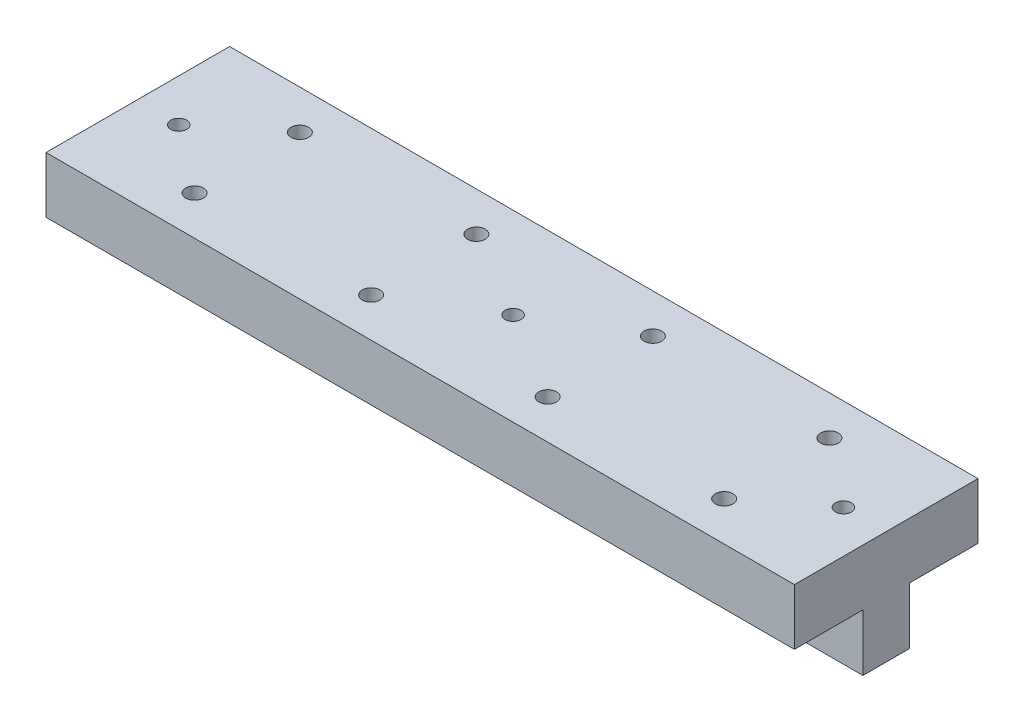
ISO-10303-21;
HEADER;
FILE_DESCRIPTION(('STEP AP214'),'2;1');
FILE_NAME('part.step','',(''),(''),'','','');
FILE_SCHEMA(('AUTOMOTIVE_DESIGN { 1 0 10303 214 1 1 1 1 }'));
ENDSEC;
DATA;
#1=APPLICATION_CONTEXT('core data for automotive mechanical design processes');
#2=APPLICATION_PROTOCOL_DEFINITION('international standard','automotive_design',2000,#1);
#3=PRODUCT_CONTEXT('',#1,'mechanical');
#4=PRODUCT('Part','Part','',(#3));
#5=PRODUCT_RELATED_PRODUCT_CATEGORY('part','',(#4));
#6=PRODUCT_DEFINITION_FORMATION('','',#4);
#7=PRODUCT_DEFINITION_CONTEXT('part definition',#1,'design');
#8=PRODUCT_DEFINITION('design','',#6,#7);
#9=PRODUCT_DEFINITION_SHAPE('','',#8);
#10=(LENGTH_UNIT() NAMED_UNIT(*) SI_UNIT(.MILLI.,.METRE.));
#11=(NAMED_UNIT(*) PLANE_ANGLE_UNIT() SI_UNIT($,.RADIAN.));
#12=(NAMED_UNIT(*) SI_UNIT($,.STERADIAN.) SOLID_ANGLE_UNIT());
#13=UNCERTAINTY_MEASURE_WITH_UNIT(LENGTH_MEASURE(1.E-05),#10,'distance_accuracy_value','');
#14=(GEOMETRIC_REPRESENTATION_CONTEXT(3) GLOBAL_UNCERTAINTY_ASSIGNED_CONTEXT((#13)) GLOBAL_UNIT_ASSIGNED_CONTEXT((#10,
#11,#12)) REPRESENTATION_CONTEXT('',''));
#15=CARTESIAN_POINT('',(0.,0.,0.));
#16=DIRECTION('',(0.,0.,1.));
#17=DIRECTION('',(1.,0.,0.));
#18=AXIS2_PLACEMENT_3D('',#15,#16,#17);
#19=CARTESIAN_POINT('',(-89.8910476017454,-16.65,-13.));
#20=DIRECTION('',(0.,1.,0.));
#21=DIRECTION('',(0.,0.,1.));
#22=AXIS2_PLACEMENT_3D('',#19,#20,#21);
#23=PLANE('',#22);
#24=DIRECTION('',(-1.,0.,0.));
#25=VECTOR('',#24,1.);
#26=CARTESIAN_POINT('',(-89.8910476017454,-16.65,0.));
#27=LINE('',#26,#25);
#28=CARTESIAN_POINT('',(16.1089523982546,-16.65,0.));
#29=VERTEX_POINT('',#28);
#30=CARTESIAN_POINT('',(-89.8910476017454,-16.65,0.));
#31=VERTEX_POINT('',#30);
#32=EDGE_CURVE('E170',#29,#31,#27,.T.);
#33=ORIENTED_EDGE('',*,*,#32,.F.);
#34=DIRECTION('',(0.,0.,1.));
#35=VECTOR('',#34,1.);
#36=CARTESIAN_POINT('',(16.1089523982546,-16.65,-13.));
#37=LINE('',#36,#35);
#38=CARTESIAN_POINT('',(16.1089523982546,-16.65,-26.));
#39=VERTEX_POINT('',#38);
#40=EDGE_CURVE('E177',#39,#29,#37,.T.);
#41=ORIENTED_EDGE('',*,*,#40,.F.);
#42=DIRECTION('',(-1.,0.,0.));
#43=VECTOR('',#42,1.);
#44=CARTESIAN_POINT('',(-89.8910476017454,-16.65,-26.));
#45=LINE('',#44,#43);
#46=CARTESIAN_POINT('',(-89.8910476017454,-16.65,-26.));
#47=VERTEX_POINT('',#46);
#48=EDGE_CURVE('E121',#39,#47,#45,.T.);
#49=ORIENTED_EDGE('',*,*,#48,.T.);
#50=DIRECTION('',(0.,0.,1.));
#51=VECTOR('',#50,1.);
#52=CARTESIAN_POINT('',(-89.8910476017454,-16.65,-13.));
#53=LINE('',#52,#51);
#54=EDGE_CURVE('E174',#47,#31,#53,.T.);
#55=ORIENTED_EDGE('',*,*,#54,.T.);
#56=EDGE_LOOP('',(#33,#41,#49,#55));
#57=FACE_BOUND('',#56,.T.);
#58=CARTESIAN_POINT('',(-24.3910476017454,-16.65,-5.55));
#59=DIRECTION('',(0.,1.,0.));
#60=DIRECTION('',(0.,0.,1.));
#61=AXIS2_PLACEMENT_3D('',#58,#59,#60);
#62=CIRCLE('',#61,1.25);
#63=CARTESIAN_POINT('',(-24.3910476017454,-16.65,-4.3));
#64=VERTEX_POINT('',#63);
#65=EDGE_CURVE('E148',#64,#64,#62,.T.);
#66=ORIENTED_EDGE('',*,*,#65,.F.);
#67=EDGE_LOOP('',(#66));
#68=FACE_BOUND('',#67,.T.);
#69=CARTESIAN_POINT('',(0.608952398254592,-16.65,-5.55));
#70=DIRECTION('',(0.,1.,0.));
#71=DIRECTION('',(0.,0.,1.));
#72=AXIS2_PLACEMENT_3D('',#69,#70,#71);
#73=CIRCLE('',#72,1.25);
#74=CARTESIAN_POINT('',(0.608952398254592,-16.65,-4.3));
#75=VERTEX_POINT('',#74);
#76=EDGE_CURVE('E142',#75,#75,#73,.T.);
#77=ORIENTED_EDGE('',*,*,#76,.F.);
#78=EDGE_LOOP('',(#77));
#79=FACE_BOUND('',#78,.T.);
#80=CARTESIAN_POINT('',(-49.3910476017454,-16.65,-5.55));
#81=DIRECTION('',(0.,1.,0.));
#82=DIRECTION('',(0.,0.,1.));
#83=AXIS2_PLACEMENT_3D('',#80,#81,#82);
#84=CIRCLE('',#83,1.24999999999999);
#85=CARTESIAN_POINT('',(-49.3910476017454,-16.65,-4.30000000000001));
#86=VERTEX_POINT('',#85);
#87=EDGE_CURVE('E136',#86,#86,#84,.T.);
#88=ORIENTED_EDGE('',*,*,#87,.F.);
#89=EDGE_LOOP('',(#88));
#90=FACE_BOUND('',#89,.T.);
#91=CARTESIAN_POINT('',(-74.3910476017454,-16.65,-5.55));
#92=DIRECTION('',(0.,1.,0.));
#93=DIRECTION('',(0.,0.,1.));
#94=AXIS2_PLACEMENT_3D('',#91,#92,#93);
#95=CIRCLE('',#94,1.25);
#96=CARTESIAN_POINT('',(-74.3910476017454,-16.65,-4.3));
#97=VERTEX_POINT('',#96);
#98=EDGE_CURVE('E130',#97,#97,#95,.T.);
#99=ORIENTED_EDGE('',*,*,#98,.F.);
#100=EDGE_LOOP('',(#99));
#101=FACE_BOUND('',#100,.T.);
#102=CARTESIAN_POINT('',(-24.3910476017454,-16.65,-20.45));
#103=DIRECTION('',(0.,1.,0.));
#104=DIRECTION('',(0.,0.,1.));
#105=AXIS2_PLACEMENT_3D('',#102,#103,#104);
#106=CIRCLE('',#105,1.25);
#107=CARTESIAN_POINT('',(-24.3910476017454,-16.65,-19.2));
#108=VERTEX_POINT('',#107);
#109=EDGE_CURVE('E207',#108,#108,#106,.T.);
#110=ORIENTED_EDGE('',*,*,#109,.F.);
#111=EDGE_LOOP('',(#110));
#112=FACE_BOUND('',#111,.T.);
#113=CARTESIAN_POINT('',(0.608952398254592,-16.65,-20.45));
#114=DIRECTION('',(0.,1.,0.));
#115=DIRECTION('',(0.,0.,1.));
#116=AXIS2_PLACEMENT_3D('',#113,#114,#115);
#117=CIRCLE('',#116,1.25);
#118=CARTESIAN_POINT('',(0.608952398254592,-16.65,-19.2));
#119=VERTEX_POINT('',#118);
#120=EDGE_CURVE('E189',#119,#119,#117,.T.);
#121=ORIENTED_EDGE('',*,*,#120,.F.);
#122=EDGE_LOOP('',(#121));
#123=FACE_BOUND('',#122,.T.);
#124=CARTESIAN_POINT('',(-49.3910476017454,-16.65,-20.45));
#125=DIRECTION('',(0.,1.,0.));
#126=DIRECTION('',(0.,0.,1.));
#127=AXIS2_PLACEMENT_3D('',#124,#125,#126);
#128=CIRCLE('',#127,1.24999999999999);
#129=CARTESIAN_POINT('',(-49.3910476017454,-16.65,-19.2));
#130=VERTEX_POINT('',#129);
#131=EDGE_CURVE('E190',#130,#130,#128,.T.);
#132=ORIENTED_EDGE('',*,*,#131,.F.);
#133=EDGE_LOOP('',(#132));
#134=FACE_BOUND('',#133,.T.);
#135=CARTESIAN_POINT('',(-74.3910476017454,-16.65,-20.45));
#136=DIRECTION('',(0.,1.,0.));
#137=DIRECTION('',(0.,0.,1.));
#138=AXIS2_PLACEMENT_3D('',#135,#136,#137);
#139=CIRCLE('',#138,1.25);
#140=CARTESIAN_POINT('',(-74.3910476017454,-16.65,-19.2));
#141=VERTEX_POINT('',#140);
#142=EDGE_CURVE('E201',#141,#141,#139,.T.);
#143=ORIENTED_EDGE('',*,*,#142,.F.);
#144=EDGE_LOOP('',(#143));
#145=FACE_BOUND('',#144,.T.);
#146=CARTESIAN_POINT('',(-36.8910476017454,-16.65,-13.1568071765675));
#147=DIRECTION('',(0.,-1.,0.));
#148=DIRECTION('',(0.,0.,-1.));
#149=AXIS2_PLACEMENT_3D('',#146,#147,#148);
#150=CIRCLE('',#149,1.13029999999999);
#151=CARTESIAN_POINT('',(-36.8910476017454,-16.65,-14.2871071765675));
#152=VERTEX_POINT('',#151);
#153=EDGE_CURVE('E480',#152,#152,#150,.T.);
#154=ORIENTED_EDGE('',*,*,#153,.T.);
#155=EDGE_LOOP('',(#154));
#156=FACE_BOUND('',#155,.T.);
#157=CARTESIAN_POINT('',(10.1089523982546,-16.65,-12.9381847081124));
#158=DIRECTION('',(0.,-1.,0.));
#159=DIRECTION('',(0.,0.,-1.));
#160=AXIS2_PLACEMENT_3D('',#157,#158,#159);
#161=CIRCLE('',#160,1.1303);
#162=CARTESIAN_POINT('',(10.1089523982546,-16.65,-14.0684847081123));
#163=VERTEX_POINT('',#162);
#164=EDGE_CURVE('E484',#163,#163,#161,.T.);
#165=ORIENTED_EDGE('',*,*,#164,.T.);
#166=EDGE_LOOP('',(#165));
#167=FACE_BOUND('',#166,.T.);
#168=CARTESIAN_POINT('',(-83.8910476017454,-16.65,-12.8014145682755));
#169=DIRECTION('',(0.,-1.,0.));
#170=DIRECTION('',(0.,0.,-1.));
#171=AXIS2_PLACEMENT_3D('',#168,#169,#170);
#172=CIRCLE('',#171,1.1303);
#173=CARTESIAN_POINT('',(-83.8910476017454,-16.65,-13.9317145682755));
#174=VERTEX_POINT('',#173);
#175=EDGE_CURVE('E487',#174,#174,#172,.T.);
#176=ORIENTED_EDGE('',*,*,#175,.T.);
#177=EDGE_LOOP('',(#176));
#178=FACE_BOUND('',#177,.T.);
#179=ADVANCED_FACE('F35',(#57,#68,#79,#90,#101,#112,#123,#134,#145,#156,#167,#178),#23,.T.);
#180=CARTESIAN_POINT('',(-89.8910476017454,-32.65,-13.));
#181=DIRECTION('',(0.,-1.,0.));
#182=DIRECTION('',(0.,0.,-1.));
#183=AXIS2_PLACEMENT_3D('',#180,#181,#182);
#184=PLANE('',#183);
#185=CARTESIAN_POINT('',(-83.8910476017454,-32.65,-12.8014145682755));
#186=DIRECTION('',(0.,-1.,0.));
#187=DIRECTION('',(0.,0.,-1.));
#188=AXIS2_PLACEMENT_3D('',#185,#186,#187);
#189=CIRCLE('',#188,1.1303);
#190=CARTESIAN_POINT('',(-83.8910476017454,-32.65,-13.9317145682755));
#191=VERTEX_POINT('',#190);
#192=EDGE_CURVE('E489',#191,#191,#189,.T.);
#193=ORIENTED_EDGE('',*,*,#192,.F.);
#194=EDGE_LOOP('',(#193));
#195=FACE_BOUND('',#194,.T.);
#196=CARTESIAN_POINT('',(10.1089523982546,-32.65,-12.9381847081124));
#197=DIRECTION('',(0.,-1.,0.));
#198=DIRECTION('',(0.,0.,-1.));
#199=AXIS2_PLACEMENT_3D('',#196,#197,#198);
#200=CIRCLE('',#199,1.1303);
#201=CARTESIAN_POINT('',(10.1089523982546,-32.65,-14.0684847081124));
#202=VERTEX_POINT('',#201);
#203=EDGE_CURVE('E488',#202,#202,#200,.T.);
#204=ORIENTED_EDGE('',*,*,#203,.F.);
#205=EDGE_LOOP('',(#204));
#206=FACE_BOUND('',#205,.T.);
#207=CARTESIAN_POINT('',(-36.8910476017454,-32.65,-13.1568071765675));
#208=DIRECTION('',(0.,-1.,0.));
#209=DIRECTION('',(0.,0.,-1.));
#210=AXIS2_PLACEMENT_3D('',#207,#208,#209);
#211=CIRCLE('',#210,1.1303);
#212=CARTESIAN_POINT('',(-36.8910476017454,-32.65,-14.2871071765675));
#213=VERTEX_POINT('',#212);
#214=EDGE_CURVE('E497',#213,#213,#211,.T.);
#215=ORIENTED_EDGE('',*,*,#214,.F.);
#216=EDGE_LOOP('',(#215));
#217=FACE_BOUND('',#216,.T.);
#218=DIRECTION('',(0.,0.,1.));
#219=VECTOR('',#218,1.);
#220=CARTESIAN_POINT('',(-89.8910476017454,-32.65,-13.));
#221=LINE('',#220,#219);
#222=CARTESIAN_POINT('',(-89.8910476017454,-32.65,-16.3));
#223=VERTEX_POINT('',#222);
#224=CARTESIAN_POINT('',(-89.8910476017454,-32.65,-9.7));
#225=VERTEX_POINT('',#224);
#226=EDGE_CURVE('E173',#223,#225,#221,.T.);
#227=ORIENTED_EDGE('',*,*,#226,.F.);
#228=DIRECTION('',(1.,0.,0.));
#229=VECTOR('',#228,1.);
#230=CARTESIAN_POINT('',(-89.8910476017454,-32.65,-16.3));
#231=LINE('',#230,#229);
#232=CARTESIAN_POINT('',(16.1089523982546,-32.65,-16.3));
#233=VERTEX_POINT('',#232);
#234=EDGE_CURVE('E11',#223,#233,#231,.T.);
#235=ORIENTED_EDGE('',*,*,#234,.T.);
#236=DIRECTION('',(0.,0.,1.));
#237=VECTOR('',#236,1.);
#238=CARTESIAN_POINT('',(16.1089523982546,-32.65,-13.));
#239=LINE('',#238,#237);
#240=CARTESIAN_POINT('',(16.1089523982546,-32.65,-9.7));
#241=VERTEX_POINT('',#240);
#242=EDGE_CURVE('E180',#233,#241,#239,.T.);
#243=ORIENTED_EDGE('',*,*,#242,.T.);
#244=DIRECTION('',(-1.,0.,0.));
#245=VECTOR('',#244,1.);
#246=CARTESIAN_POINT('',(-89.8910476017454,-32.65,-9.7));
#247=LINE('',#246,#245);
#248=EDGE_CURVE('E184',#241,#225,#247,.T.);
#249=ORIENTED_EDGE('',*,*,#248,.T.);
#250=EDGE_LOOP('',(#227,#235,#243,#249));
#251=FACE_BOUND('',#250,.T.);
#252=ADVANCED_FACE('F217',(#195,#206,#217,#251),#184,.T.);
#253=CARTESIAN_POINT('',(-89.8910476017454,-16.65,-13.));
#254=DIRECTION('',(-1.,0.,0.));
#255=DIRECTION('',(0.,0.,1.));
#256=AXIS2_PLACEMENT_3D('',#253,#254,#255);
#257=PLANE('',#256);
#258=DIRECTION('',(0.,0.,1.));
#259=VECTOR('',#258,1.);
#260=CARTESIAN_POINT('',(-89.8910476017454,-24.6013169762694,-26.000012));
#261=LINE('',#260,#259);
#262=CARTESIAN_POINT('',(-89.8910476017454,-24.6013169762694,-26.));
#263=VERTEX_POINT('',#262);
#264=CARTESIAN_POINT('',(-89.8910476017454,-24.6013169762694,-16.3));
#265=VERTEX_POINT('',#264);
#266=EDGE_CURVE('E52',#263,#265,#261,.T.);
#267=ORIENTED_EDGE('',*,*,#266,.T.);
#268=DIRECTION('',(0.,-1.,0.));
#269=VECTOR('',#268,1.);
#270=CARTESIAN_POINT('',(-89.8910476017454,-24.6013169762694,-16.3));
#271=LINE('',#270,#269);
#272=EDGE_CURVE('E109',#265,#223,#271,.T.);
#273=ORIENTED_EDGE('',*,*,#272,.T.);
#274=ORIENTED_EDGE('',*,*,#226,.T.);
#275=DIRECTION('',(0.,-1.,0.));
#276=VECTOR('',#275,1.);
#277=CARTESIAN_POINT('',(-89.8910476017454,-24.6013169762694,-9.7));
#278=LINE('',#277,#276);
#279=CARTESIAN_POINT('',(-89.8910476017454,-24.6013169762694,-9.7));
#280=VERTEX_POINT('',#279);
#281=EDGE_CURVE('E154',#280,#225,#278,.T.);
#282=ORIENTED_EDGE('',*,*,#281,.F.);
#283=DIRECTION('',(0.,0.,-1.));
#284=VECTOR('',#283,1.);
#285=CARTESIAN_POINT('',(-89.8910476017454,-24.6013169762694,1.2E-05));
#286=LINE('',#285,#284);
#287=CARTESIAN_POINT('',(-89.8910476017454,-24.6013169762694,0.));
#288=VERTEX_POINT('',#287);
#289=EDGE_CURVE('E162',#288,#280,#286,.T.);
#290=ORIENTED_EDGE('',*,*,#289,.F.);
#291=DIRECTION('',(0.,-1.,0.));
#292=VECTOR('',#291,1.);
#293=CARTESIAN_POINT('',(-89.8910476017454,-16.65,0.));
#294=LINE('',#293,#292);
#295=EDGE_CURVE('E165',#31,#288,#294,.T.);
#296=ORIENTED_EDGE('',*,*,#295,.F.);
#297=ORIENTED_EDGE('',*,*,#54,.F.);
#298=DIRECTION('',(0.,-1.,0.));
#299=VECTOR('',#298,1.);
#300=CARTESIAN_POINT('',(-89.8910476017454,-16.65,-26.));
#301=LINE('',#300,#299);
#302=EDGE_CURVE('E119',#47,#263,#301,.T.);
#303=ORIENTED_EDGE('',*,*,#302,.T.);
#304=EDGE_LOOP('',(#267,#273,#274,#282,#290,#296,#297,#303));
#305=FACE_BOUND('',#304,.T.);
#306=ADVANCED_FACE('F37',(#305),#257,.T.);
#307=CARTESIAN_POINT('',(16.1089523982546,-16.65,-13.));
#308=DIRECTION('',(1.,0.,0.));
#309=DIRECTION('',(0.,0.,-1.));
#310=AXIS2_PLACEMENT_3D('',#307,#308,#309);
#311=PLANE('',#310);
#312=DIRECTION('',(0.,0.,1.));
#313=VECTOR('',#312,1.);
#314=CARTESIAN_POINT('',(16.1089523982546,-24.6013169762694,-26.000012));
#315=LINE('',#314,#313);
#316=CARTESIAN_POINT('',(16.1089523982546,-24.6013169762694,-26.));
#317=VERTEX_POINT('',#316);
#318=CARTESIAN_POINT('',(16.1089523982546,-24.6013169762694,-16.3));
#319=VERTEX_POINT('',#318);
#320=EDGE_CURVE('E105',#317,#319,#315,.T.);
#321=ORIENTED_EDGE('',*,*,#320,.F.);
#322=DIRECTION('',(0.,1.,0.));
#323=VECTOR('',#322,1.);
#324=CARTESIAN_POINT('',(16.1089523982546,-16.65,-26.));
#325=LINE('',#324,#323);
#326=EDGE_CURVE('E128',#317,#39,#325,.T.);
#327=ORIENTED_EDGE('',*,*,#326,.T.);
#328=ORIENTED_EDGE('',*,*,#40,.T.);
#329=DIRECTION('',(0.,1.,0.));
#330=VECTOR('',#329,1.);
#331=CARTESIAN_POINT('',(16.1089523982546,-16.65,0.));
#332=LINE('',#331,#330);
#333=CARTESIAN_POINT('',(16.1089523982546,-24.6013169762694,0.));
#334=VERTEX_POINT('',#333);
#335=EDGE_CURVE('E168',#334,#29,#332,.T.);
#336=ORIENTED_EDGE('',*,*,#335,.F.);
#337=DIRECTION('',(0.,0.,-1.));
#338=VECTOR('',#337,1.);
#339=CARTESIAN_POINT('',(16.1089523982546,-24.6013169762694,1.2E-05));
#340=LINE('',#339,#338);
#341=CARTESIAN_POINT('',(16.1089523982546,-24.6013169762694,-9.7));
#342=VERTEX_POINT('',#341);
#343=EDGE_CURVE('E60',#334,#342,#340,.T.);
#344=ORIENTED_EDGE('',*,*,#343,.T.);
#345=DIRECTION('',(0.,1.,0.));
#346=VECTOR('',#345,1.);
#347=CARTESIAN_POINT('',(16.1089523982546,-24.6013169762694,-9.7));
#348=LINE('',#347,#346);
#349=EDGE_CURVE('E157',#241,#342,#348,.T.);
#350=ORIENTED_EDGE('',*,*,#349,.F.);
#351=ORIENTED_EDGE('',*,*,#242,.F.);
#352=DIRECTION('',(0.,1.,0.));
#353=VECTOR('',#352,1.);
#354=CARTESIAN_POINT('',(16.1089523982546,-24.6013169762694,-16.3));
#355=LINE('',#354,#353);
#356=EDGE_CURVE('E108',#233,#319,#355,.T.);
#357=ORIENTED_EDGE('',*,*,#356,.T.);
#358=EDGE_LOOP('',(#321,#327,#328,#336,#344,#350,#351,#357));
#359=FACE_BOUND('',#358,.T.);
#360=ADVANCED_FACE('F213',(#359),#311,.T.);
#361=CARTESIAN_POINT('',(0.,0.,0.));
#362=DIRECTION('',(0.,0.,1.));
#363=DIRECTION('',(1.,0.,0.));
#364=AXIS2_PLACEMENT_3D('',#361,#362,#363);
#365=PLANE('',#364);
#366=ORIENTED_EDGE('',*,*,#295,.T.);
#367=DIRECTION('',(1.,0.,0.));
#368=VECTOR('',#367,1.);
#369=CARTESIAN_POINT('',(0.,-24.6013169762694,0.));
#370=LINE('',#369,#368);
#371=EDGE_CURVE('E176',#288,#334,#370,.T.);
#372=ORIENTED_EDGE('',*,*,#371,.T.);
#373=ORIENTED_EDGE('',*,*,#335,.T.);
#374=ORIENTED_EDGE('',*,*,#32,.T.);
#375=EDGE_LOOP('',(#366,#372,#373,#374));
#376=FACE_BOUND('',#375,.T.);
#377=ADVANCED_FACE('F228',(#376),#365,.T.);
#378=CARTESIAN_POINT('',(-89.8910476017454,-24.6013169762694,1.2E-05));
#379=DIRECTION('',(0.,-1.,0.));
#380=DIRECTION('',(0.,0.,-1.));
#381=AXIS2_PLACEMENT_3D('',#378,#379,#380);
#382=PLANE('',#381);
#383=CARTESIAN_POINT('',(-74.3910476017454,-24.6013169762694,-5.55));
#384=DIRECTION('',(0.,-1.,0.));
#385=DIRECTION('',(0.,0.,-1.));
#386=AXIS2_PLACEMENT_3D('',#383,#384,#385);
#387=CIRCLE('',#386,1.25);
#388=CARTESIAN_POINT('',(-74.3910476017454,-24.6013169762694,-6.8));
#389=VERTEX_POINT('',#388);
#390=EDGE_CURVE('E133',#389,#389,#387,.T.);
#391=ORIENTED_EDGE('',*,*,#390,.F.);
#392=EDGE_LOOP('',(#391));
#393=FACE_BOUND('',#392,.T.);
#394=CARTESIAN_POINT('',(-49.3910476017454,-24.6013169762694,-5.55));
#395=DIRECTION('',(0.,-1.,0.));
#396=DIRECTION('',(0.,0.,-1.));
#397=AXIS2_PLACEMENT_3D('',#394,#395,#396);
#398=CIRCLE('',#397,1.24999999999999);
#399=CARTESIAN_POINT('',(-49.3910476017454,-24.6013169762694,-6.79999999999999));
#400=VERTEX_POINT('',#399);
#401=EDGE_CURVE('E139',#400,#400,#398,.T.);
#402=ORIENTED_EDGE('',*,*,#401,.F.);
#403=EDGE_LOOP('',(#402));
#404=FACE_BOUND('',#403,.T.);
#405=CARTESIAN_POINT('',(0.608952398254592,-24.6013169762694,-5.55));
#406=DIRECTION('',(0.,-1.,0.));
#407=DIRECTION('',(0.,0.,-1.));
#408=AXIS2_PLACEMENT_3D('',#405,#406,#407);
#409=CIRCLE('',#408,1.25);
#410=CARTESIAN_POINT('',(0.608952398254592,-24.6013169762694,-6.8));
#411=VERTEX_POINT('',#410);
#412=EDGE_CURVE('E145',#411,#411,#409,.T.);
#413=ORIENTED_EDGE('',*,*,#412,.F.);
#414=EDGE_LOOP('',(#413));
#415=FACE_BOUND('',#414,.T.);
#416=CARTESIAN_POINT('',(-24.3910476017454,-24.6013169762694,-5.55));
#417=DIRECTION('',(0.,-1.,0.));
#418=DIRECTION('',(0.,0.,-1.));
#419=AXIS2_PLACEMENT_3D('',#416,#417,#418);
#420=CIRCLE('',#419,1.25);
#421=CARTESIAN_POINT('',(-24.3910476017454,-24.6013169762694,-6.8));
#422=VERTEX_POINT('',#421);
#423=EDGE_CURVE('E151',#422,#422,#420,.T.);
#424=ORIENTED_EDGE('',*,*,#423,.F.);
#425=EDGE_LOOP('',(#424));
#426=FACE_BOUND('',#425,.T.);
#427=ORIENTED_EDGE('',*,*,#289,.T.);
#428=DIRECTION('',(-1.,0.,0.));
#429=VECTOR('',#428,1.);
#430=CARTESIAN_POINT('',(-89.8910476017454,-24.6013169762694,-9.7));
#431=LINE('',#430,#429);
#432=EDGE_CURVE('E159',#342,#280,#431,.T.);
#433=ORIENTED_EDGE('',*,*,#432,.F.);
#434=ORIENTED_EDGE('',*,*,#343,.F.);
#435=ORIENTED_EDGE('',*,*,#371,.F.);
#436=EDGE_LOOP('',(#427,#433,#434,#435));
#437=FACE_BOUND('',#436,.T.);
#438=ADVANCED_FACE('F223',(#393,#404,#415,#426,#437),#382,.T.);
#439=CARTESIAN_POINT('',(0.,0.,-9.7));
#440=DIRECTION('',(0.,0.,1.));
#441=DIRECTION('',(1.,0.,0.));
#442=AXIS2_PLACEMENT_3D('',#439,#440,#441);
#443=PLANE('',#442);
#444=ORIENTED_EDGE('',*,*,#349,.T.);
#445=ORIENTED_EDGE('',*,*,#432,.T.);
#446=ORIENTED_EDGE('',*,*,#281,.T.);
#447=ORIENTED_EDGE('',*,*,#248,.F.);
#448=EDGE_LOOP('',(#444,#445,#446,#447));
#449=FACE_BOUND('',#448,.T.);
#450=ADVANCED_FACE('F222',(#449),#443,.T.);
#451=CARTESIAN_POINT('',(-24.3910476017454,-16.65,-5.55));
#452=DIRECTION('',(0.,1.,0.));
#453=DIRECTION('',(0.,0.,1.));
#454=AXIS2_PLACEMENT_3D('',#451,#452,#453);
#455=CYLINDRICAL_SURFACE('',#454,1.25);
#456=ORIENTED_EDGE('',*,*,#423,.T.);
#457=EDGE_LOOP('',(#456));
#458=FACE_BOUND('',#457,.T.);
#459=ORIENTED_EDGE('',*,*,#65,.T.);
#460=EDGE_LOOP('',(#459));
#461=FACE_BOUND('',#460,.T.);
#462=ADVANCED_FACE('F352',(#458,#461),#455,.F.);
#463=CARTESIAN_POINT('',(0.608952398254592,-16.65,-5.55));
#464=DIRECTION('',(0.,1.,0.));
#465=DIRECTION('',(0.,0.,1.));
#466=AXIS2_PLACEMENT_3D('',#463,#464,#465);
#467=CYLINDRICAL_SURFACE('',#466,1.25);
#468=ORIENTED_EDGE('',*,*,#412,.T.);
#469=EDGE_LOOP('',(#468));
#470=FACE_BOUND('',#469,.T.);
#471=ORIENTED_EDGE('',*,*,#76,.T.);
#472=EDGE_LOOP('',(#471));
#473=FACE_BOUND('',#472,.T.);
#474=ADVANCED_FACE('F357',(#470,#473),#467,.F.);
#475=CARTESIAN_POINT('',(-49.3910476017454,-16.65,-5.55));
#476=DIRECTION('',(0.,1.,0.));
#477=DIRECTION('',(0.,0.,1.));
#478=AXIS2_PLACEMENT_3D('',#475,#476,#477);
#479=CYLINDRICAL_SURFACE('',#478,1.24999999999999);
#480=ORIENTED_EDGE('',*,*,#401,.T.);
#481=EDGE_LOOP('',(#480));
#482=FACE_BOUND('',#481,.T.);
#483=ORIENTED_EDGE('',*,*,#87,.T.);
#484=EDGE_LOOP('',(#483));
#485=FACE_BOUND('',#484,.T.);
#486=ADVANCED_FACE('F244',(#482,#485),#479,.F.);
#487=CARTESIAN_POINT('',(-74.3910476017454,-16.65,-5.55));
#488=DIRECTION('',(0.,1.,0.));
#489=DIRECTION('',(0.,0.,1.));
#490=AXIS2_PLACEMENT_3D('',#487,#488,#489);
#491=CYLINDRICAL_SURFACE('',#490,1.25);
#492=ORIENTED_EDGE('',*,*,#390,.T.);
#493=EDGE_LOOP('',(#492));
#494=FACE_BOUND('',#493,.T.);
#495=ORIENTED_EDGE('',*,*,#98,.T.);
#496=EDGE_LOOP('',(#495));
#497=FACE_BOUND('',#496,.T.);
#498=ADVANCED_FACE('F236',(#494,#497),#491,.F.);
#499=CARTESIAN_POINT('',(0.,0.,-26.));
#500=DIRECTION('',(0.,0.,-1.));
#501=DIRECTION('',(1.,0.,0.));
#502=AXIS2_PLACEMENT_3D('',#499,#500,#501);
#503=PLANE('',#502);
#504=DIRECTION('',(1.,0.,0.));
#505=VECTOR('',#504,1.);
#506=CARTESIAN_POINT('',(0.,-24.6013169762694,-26.));
#507=LINE('',#506,#505);
#508=EDGE_CURVE('E44',#263,#317,#507,.T.);
#509=ORIENTED_EDGE('',*,*,#508,.F.);
#510=ORIENTED_EDGE('',*,*,#302,.F.);
#511=ORIENTED_EDGE('',*,*,#48,.F.);
#512=ORIENTED_EDGE('',*,*,#326,.F.);
#513=EDGE_LOOP('',(#509,#510,#511,#512));
#514=FACE_BOUND('',#513,.T.);
#515=ADVANCED_FACE('F234',(#514),#503,.T.);
#516=CARTESIAN_POINT('',(-89.8910476017454,-24.6013169762694,-26.000012));
#517=DIRECTION('',(0.,1.,0.));
#518=DIRECTION('',(0.,0.,1.));
#519=AXIS2_PLACEMENT_3D('',#516,#517,#518);
#520=PLANE('',#519);
#521=CARTESIAN_POINT('',(-74.3910476017454,-24.6013169762694,-20.45));
#522=DIRECTION('',(0.,1.,0.));
#523=DIRECTION('',(0.,0.,1.));
#524=AXIS2_PLACEMENT_3D('',#521,#522,#523);
#525=CIRCLE('',#524,1.25);
#526=CARTESIAN_POINT('',(-74.3910476017454,-24.6013169762694,-19.2));
#527=VERTEX_POINT('',#526);
#528=EDGE_CURVE('E39',#527,#527,#525,.T.);
#529=ORIENTED_EDGE('',*,*,#528,.T.);
#530=EDGE_LOOP('',(#529));
#531=FACE_BOUND('',#530,.T.);
#532=CARTESIAN_POINT('',(-49.3910476017454,-24.6013169762694,-20.45));
#533=DIRECTION('',(0.,1.,0.));
#534=DIRECTION('',(0.,0.,1.));
#535=AXIS2_PLACEMENT_3D('',#532,#533,#534);
#536=CIRCLE('',#535,1.24999999999999);
#537=CARTESIAN_POINT('',(-49.3910476017454,-24.6013169762694,-19.2));
#538=VERTEX_POINT('',#537);
#539=EDGE_CURVE('E187',#538,#538,#536,.T.);
#540=ORIENTED_EDGE('',*,*,#539,.T.);
#541=EDGE_LOOP('',(#540));
#542=FACE_BOUND('',#541,.T.);
#543=CARTESIAN_POINT('',(0.608952398254592,-24.6013169762694,-20.45));
#544=DIRECTION('',(0.,1.,0.));
#545=DIRECTION('',(0.,0.,1.));
#546=AXIS2_PLACEMENT_3D('',#543,#544,#545);
#547=CIRCLE('',#546,1.25);
#548=CARTESIAN_POINT('',(0.608952398254592,-24.6013169762694,-19.2));
#549=VERTEX_POINT('',#548);
#550=EDGE_CURVE('E194',#549,#549,#547,.T.);
#551=ORIENTED_EDGE('',*,*,#550,.T.);
#552=EDGE_LOOP('',(#551));
#553=FACE_BOUND('',#552,.T.);
#554=CARTESIAN_POINT('',(-24.3910476017454,-24.6013169762694,-20.45));
#555=DIRECTION('',(0.,1.,0.));
#556=DIRECTION('',(0.,0.,1.));
#557=AXIS2_PLACEMENT_3D('',#554,#555,#556);
#558=CIRCLE('',#557,1.25);
#559=CARTESIAN_POINT('',(-24.3910476017454,-24.6013169762694,-19.2));
#560=VERTEX_POINT('',#559);
#561=EDGE_CURVE('E115',#560,#560,#558,.T.);
#562=ORIENTED_EDGE('',*,*,#561,.T.);
#563=EDGE_LOOP('',(#562));
#564=FACE_BOUND('',#563,.T.);
#565=ORIENTED_EDGE('',*,*,#508,.T.);
#566=ORIENTED_EDGE('',*,*,#320,.T.);
#567=DIRECTION('',(-1.,0.,0.));
#568=VECTOR('',#567,1.);
#569=CARTESIAN_POINT('',(-89.8910476017454,-24.6013169762694,-16.3));
#570=LINE('',#569,#568);
#571=EDGE_CURVE('E101',#319,#265,#570,.T.);
#572=ORIENTED_EDGE('',*,*,#571,.T.);
#573=ORIENTED_EDGE('',*,*,#266,.F.);
#574=EDGE_LOOP('',(#565,#566,#572,#573));
#575=FACE_BOUND('',#574,.T.);
#576=ADVANCED_FACE('F103',(#531,#542,#553,#564,#575),#520,.F.);
#577=CARTESIAN_POINT('',(0.,0.,-16.3));
#578=DIRECTION('',(0.,0.,-1.));
#579=DIRECTION('',(1.,0.,0.));
#580=AXIS2_PLACEMENT_3D('',#577,#578,#579);
#581=PLANE('',#580);
#582=ORIENTED_EDGE('',*,*,#272,.F.);
#583=ORIENTED_EDGE('',*,*,#571,.F.);
#584=ORIENTED_EDGE('',*,*,#356,.F.);
#585=ORIENTED_EDGE('',*,*,#234,.F.);
#586=EDGE_LOOP('',(#582,#583,#584,#585));
#587=FACE_BOUND('',#586,.T.);
#588=ADVANCED_FACE('F112',(#587),#581,.T.);
#589=CARTESIAN_POINT('',(-24.3910476017454,-16.65,-20.45));
#590=DIRECTION('',(0.,1.,0.));
#591=DIRECTION('',(0.,0.,1.));
#592=AXIS2_PLACEMENT_3D('',#589,#590,#591);
#593=CYLINDRICAL_SURFACE('',#592,1.25);
#594=ORIENTED_EDGE('',*,*,#109,.T.);
#595=EDGE_LOOP('',(#594));
#596=FACE_BOUND('',#595,.T.);
#597=ORIENTED_EDGE('',*,*,#561,.F.);
#598=EDGE_LOOP('',(#597));
#599=FACE_BOUND('',#598,.T.);
#600=ADVANCED_FACE('F335',(#596,#599),#593,.F.);
#601=CARTESIAN_POINT('',(0.608952398254592,-16.65,-20.45));
#602=DIRECTION('',(0.,1.,0.));
#603=DIRECTION('',(0.,0.,1.));
#604=AXIS2_PLACEMENT_3D('',#601,#602,#603);
#605=CYLINDRICAL_SURFACE('',#604,1.25);
#606=ORIENTED_EDGE('',*,*,#120,.T.);
#607=EDGE_LOOP('',(#606));
#608=FACE_BOUND('',#607,.T.);
#609=ORIENTED_EDGE('',*,*,#550,.F.);
#610=EDGE_LOOP('',(#609));
#611=FACE_BOUND('',#610,.T.);
#612=ADVANCED_FACE('F326',(#608,#611),#605,.F.);
#613=CARTESIAN_POINT('',(-49.3910476017454,-16.65,-20.45));
#614=DIRECTION('',(0.,1.,0.));
#615=DIRECTION('',(0.,0.,1.));
#616=AXIS2_PLACEMENT_3D('',#613,#614,#615);
#617=CYLINDRICAL_SURFACE('',#616,1.24999999999999);
#618=ORIENTED_EDGE('',*,*,#131,.T.);
#619=EDGE_LOOP('',(#618));
#620=FACE_BOUND('',#619,.T.);
#621=ORIENTED_EDGE('',*,*,#539,.F.);
#622=EDGE_LOOP('',(#621));
#623=FACE_BOUND('',#622,.T.);
#624=ADVANCED_FACE('F316',(#620,#623),#617,.F.);
#625=CARTESIAN_POINT('',(-74.3910476017454,-16.65,-20.45));
#626=DIRECTION('',(0.,1.,0.));
#627=DIRECTION('',(0.,0.,1.));
#628=AXIS2_PLACEMENT_3D('',#625,#626,#627);
#629=CYLINDRICAL_SURFACE('',#628,1.25);
#630=ORIENTED_EDGE('',*,*,#142,.T.);
#631=EDGE_LOOP('',(#630));
#632=FACE_BOUND('',#631,.T.);
#633=ORIENTED_EDGE('',*,*,#528,.F.);
#634=EDGE_LOOP('',(#633));
#635=FACE_BOUND('',#634,.T.);
#636=ADVANCED_FACE('F285',(#632,#635),#629,.F.);
#637=CARTESIAN_POINT('',(-36.8910476017454,-32.65,-13.1568071765675));
#638=DIRECTION('',(0.,-1.,0.));
#639=DIRECTION('',(0.,0.,-1.));
#640=AXIS2_PLACEMENT_3D('',#637,#638,#639);
#641=CYLINDRICAL_SURFACE('',#640,1.1303);
#642=ORIENTED_EDGE('',*,*,#153,.F.);
#643=EDGE_LOOP('',(#642));
#644=FACE_BOUND('',#643,.T.);
#645=ORIENTED_EDGE('',*,*,#214,.T.);
#646=EDGE_LOOP('',(#645));
#647=FACE_BOUND('',#646,.T.);
#648=ADVANCED_FACE('F278',(#644,#647),#641,.F.);
#649=CARTESIAN_POINT('',(10.1089523982546,-32.65,-12.9381847081124));
#650=DIRECTION('',(0.,-1.,0.));
#651=DIRECTION('',(0.,0.,-1.));
#652=AXIS2_PLACEMENT_3D('',#649,#650,#651);
#653=CYLINDRICAL_SURFACE('',#652,1.1303);
#654=ORIENTED_EDGE('',*,*,#164,.F.);
#655=EDGE_LOOP('',(#654));
#656=FACE_BOUND('',#655,.T.);
#657=ORIENTED_EDGE('',*,*,#203,.T.);
#658=EDGE_LOOP('',(#657));
#659=FACE_BOUND('',#658,.T.);
#660=ADVANCED_FACE('F284',(#656,#659),#653,.F.);
#661=CARTESIAN_POINT('',(-83.8910476017454,-32.65,-12.8014145682755));
#662=DIRECTION('',(0.,-1.,0.));
#663=DIRECTION('',(0.,0.,-1.));
#664=AXIS2_PLACEMENT_3D('',#661,#662,#663);
#665=CYLINDRICAL_SURFACE('',#664,1.1303);
#666=ORIENTED_EDGE('',*,*,#175,.F.);
#667=EDGE_LOOP('',(#666));
#668=FACE_BOUND('',#667,.T.);
#669=ORIENTED_EDGE('',*,*,#192,.T.);
#670=EDGE_LOOP('',(#669));
#671=FACE_BOUND('',#670,.T.);
#672=ADVANCED_FACE('F296',(#668,#671),#665,.F.);
#673=CLOSED_SHELL('',(#179,#252,#306,#360,#377,#438,#450,#462,#474,#486,#498,#515,#576,#588,
#600,#612,#624,#636,#648,#660,#672));
#674=MANIFOLD_SOLID_BREP('B2',#673);
#675=ADVANCED_BREP_SHAPE_REPRESENTATION('',(#18,#674),#14);
#676=SHAPE_DEFINITION_REPRESENTATION(#9,#675);
ENDSEC;
END-ISO-10303-21;
